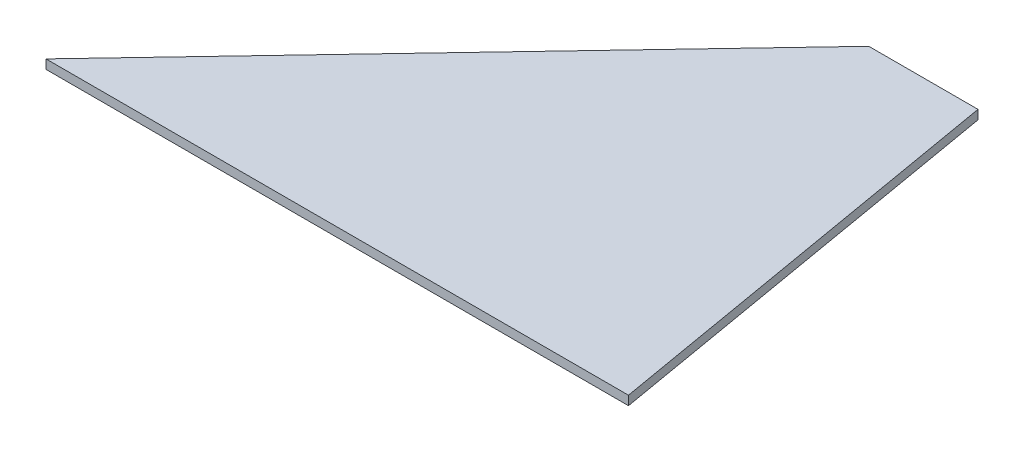
ISO-10303-21;
HEADER;
FILE_DESCRIPTION(('STEP AP214'),'2;1');
FILE_NAME('part.step','',(''),(''),'','','');
FILE_SCHEMA(('AUTOMOTIVE_DESIGN { 1 0 10303 214 1 1 1 1 }'));
ENDSEC;
DATA;
#1=APPLICATION_CONTEXT('core data for automotive mechanical design processes');
#2=APPLICATION_PROTOCOL_DEFINITION('international standard','automotive_design',2000,#1);
#3=PRODUCT_CONTEXT('',#1,'mechanical');
#4=PRODUCT('Part','Part','',(#3));
#5=PRODUCT_RELATED_PRODUCT_CATEGORY('part','',(#4));
#6=PRODUCT_DEFINITION_FORMATION('','',#4);
#7=PRODUCT_DEFINITION_CONTEXT('part definition',#1,'design');
#8=PRODUCT_DEFINITION('design','',#6,#7);
#9=PRODUCT_DEFINITION_SHAPE('','',#8);
#10=(LENGTH_UNIT() NAMED_UNIT(*) SI_UNIT(.MILLI.,.METRE.));
#11=(NAMED_UNIT(*) PLANE_ANGLE_UNIT() SI_UNIT($,.RADIAN.));
#12=(NAMED_UNIT(*) SI_UNIT($,.STERADIAN.) SOLID_ANGLE_UNIT());
#13=UNCERTAINTY_MEASURE_WITH_UNIT(LENGTH_MEASURE(1.E-05),#10,'distance_accuracy_value','');
#14=(GEOMETRIC_REPRESENTATION_CONTEXT(3) GLOBAL_UNCERTAINTY_ASSIGNED_CONTEXT((#13)) GLOBAL_UNIT_ASSIGNED_CONTEXT((#10,
#11,#12)) REPRESENTATION_CONTEXT('',''));
#15=CARTESIAN_POINT('',(0.,0.,0.));
#16=DIRECTION('',(0.,0.,1.));
#17=DIRECTION('',(1.,0.,0.));
#18=AXIS2_PLACEMENT_3D('',#15,#16,#17);
#19=CARTESIAN_POINT('',(0.,3.175,0.));
#20=DIRECTION('',(0.,0.,-1.));
#21=DIRECTION('',(-1.,0.,0.));
#22=AXIS2_PLACEMENT_3D('',#19,#20,#21);
#23=PLANE('',#22);
#24=DIRECTION('',(1.,0.,0.));
#25=VECTOR('',#24,1.);
#26=CARTESIAN_POINT('',(0.,0.,0.));
#27=LINE('',#26,#25);
#28=CARTESIAN_POINT('',(-203.2,0.,0.));
#29=VERTEX_POINT('',#28);
#30=CARTESIAN_POINT('',(0.,0.,0.));
#31=VERTEX_POINT('',#30);
#32=EDGE_CURVE('E98',#29,#31,#27,.T.);
#33=ORIENTED_EDGE('',*,*,#32,.T.);
#34=DIRECTION('',(0.,-1.,0.));
#35=VECTOR('',#34,1.);
#36=CARTESIAN_POINT('',(0.,3.175,0.));
#37=LINE('',#36,#35);
#38=CARTESIAN_POINT('',(0.,3.175,0.));
#39=VERTEX_POINT('',#38);
#40=EDGE_CURVE('E11',#39,#31,#37,.T.);
#41=ORIENTED_EDGE('',*,*,#40,.F.);
#42=DIRECTION('',(1.,0.,0.));
#43=VECTOR('',#42,1.);
#44=CARTESIAN_POINT('',(0.,3.175,0.));
#45=LINE('',#44,#43);
#46=CARTESIAN_POINT('',(-203.2,3.175,0.));
#47=VERTEX_POINT('',#46);
#48=EDGE_CURVE('E86',#47,#39,#45,.T.);
#49=ORIENTED_EDGE('',*,*,#48,.F.);
#50=DIRECTION('',(0.,-1.,0.));
#51=VECTOR('',#50,1.);
#52=CARTESIAN_POINT('',(-203.2,3.175,0.));
#53=LINE('',#52,#51);
#54=EDGE_CURVE('E94',#47,#29,#53,.T.);
#55=ORIENTED_EDGE('',*,*,#54,.T.);
#56=EDGE_LOOP('',(#33,#41,#49,#55));
#57=FACE_BOUND('',#56,.T.);
#58=ADVANCED_FACE('F35',(#57),#23,.F.);
#59=CARTESIAN_POINT('',(0.,3.175,0.));
#60=DIRECTION('',(-0.985460115744348,0.,0.169906916507646));
#61=DIRECTION('',(0.169906916507646,0.,0.985460115744348));
#62=AXIS2_PLACEMENT_3D('',#59,#60,#61);
#63=PLANE('',#62);
#64=DIRECTION('',(-0.169906916507646,0.,-0.985460115744348));
#65=VECTOR('',#64,1.);
#66=CARTESIAN_POINT('',(0.,0.,0.));
#67=LINE('',#66,#65);
#68=CARTESIAN_POINT('',(-25.4,0.,-147.32));
#69=VERTEX_POINT('',#68);
#70=EDGE_CURVE('E90',#31,#69,#67,.T.);
#71=ORIENTED_EDGE('',*,*,#70,.T.);
#72=DIRECTION('',(0.,-1.,0.));
#73=VECTOR('',#72,1.);
#74=CARTESIAN_POINT('',(-25.4,3.175,-147.32));
#75=LINE('',#74,#73);
#76=CARTESIAN_POINT('',(-25.4,3.175,-147.32));
#77=VERTEX_POINT('',#76);
#78=EDGE_CURVE('E43',#77,#69,#75,.T.);
#79=ORIENTED_EDGE('',*,*,#78,.F.);
#80=DIRECTION('',(-0.169906916507646,0.,-0.985460115744348));
#81=VECTOR('',#80,1.);
#82=CARTESIAN_POINT('',(0.,3.175,0.));
#83=LINE('',#82,#81);
#84=EDGE_CURVE('E81',#39,#77,#83,.T.);
#85=ORIENTED_EDGE('',*,*,#84,.F.);
#86=ORIENTED_EDGE('',*,*,#40,.T.);
#87=EDGE_LOOP('',(#71,#79,#85,#86));
#88=FACE_BOUND('',#87,.T.);
#89=ADVANCED_FACE('F89',(#88),#63,.F.);
#90=CARTESIAN_POINT('',(0.,3.175,-147.32));
#91=DIRECTION('',(0.,0.,1.));
#92=DIRECTION('',(1.,0.,0.));
#93=AXIS2_PLACEMENT_3D('',#90,#91,#92);
#94=PLANE('',#93);
#95=DIRECTION('',(-1.,0.,0.));
#96=VECTOR('',#95,1.);
#97=CARTESIAN_POINT('',(0.,0.,-147.32));
#98=LINE('',#97,#96);
#99=CARTESIAN_POINT('',(-63.5,0.,-147.32));
#100=VERTEX_POINT('',#99);
#101=EDGE_CURVE('E68',#69,#100,#98,.T.);
#102=ORIENTED_EDGE('',*,*,#101,.T.);
#103=DIRECTION('',(0.,-1.,0.));
#104=VECTOR('',#103,1.);
#105=CARTESIAN_POINT('',(-63.5,3.175,-147.32));
#106=LINE('',#105,#104);
#107=CARTESIAN_POINT('',(-63.5,3.175,-147.32));
#108=VERTEX_POINT('',#107);
#109=EDGE_CURVE('E91',#108,#100,#106,.T.);
#110=ORIENTED_EDGE('',*,*,#109,.F.);
#111=DIRECTION('',(-1.,0.,0.));
#112=VECTOR('',#111,1.);
#113=CARTESIAN_POINT('',(0.,3.175,-147.32));
#114=LINE('',#113,#112);
#115=EDGE_CURVE('E84',#77,#108,#114,.T.);
#116=ORIENTED_EDGE('',*,*,#115,.F.);
#117=ORIENTED_EDGE('',*,*,#78,.T.);
#118=EDGE_LOOP('',(#102,#110,#116,#117));
#119=FACE_BOUND('',#118,.T.);
#120=ADVANCED_FACE('F92',(#119),#94,.F.);
#121=CARTESIAN_POINT('',(-106.990890593207,3.175,-101.4568790108));
#122=DIRECTION('',(0.725623851173435,0.,0.688091583009292));
#123=DIRECTION('',(0.688091583009292,0.,-0.725623851173435));
#124=AXIS2_PLACEMENT_3D('',#121,#122,#123);
#125=PLANE('',#124);
#126=DIRECTION('',(-0.688091583009292,0.,0.725623851173435));
#127=VECTOR('',#126,1.);
#128=CARTESIAN_POINT('',(-106.990890593207,0.,-101.4568790108));
#129=LINE('',#128,#127);
#130=EDGE_CURVE('E74',#100,#29,#129,.T.);
#131=ORIENTED_EDGE('',*,*,#130,.T.);
#132=ORIENTED_EDGE('',*,*,#54,.F.);
#133=DIRECTION('',(-0.688091583009292,0.,0.725623851173435));
#134=VECTOR('',#133,1.);
#135=CARTESIAN_POINT('',(-106.990890593207,3.175,-101.4568790108));
#136=LINE('',#135,#134);
#137=EDGE_CURVE('E51',#108,#47,#136,.T.);
#138=ORIENTED_EDGE('',*,*,#137,.F.);
#139=ORIENTED_EDGE('',*,*,#109,.T.);
#140=EDGE_LOOP('',(#131,#132,#138,#139));
#141=FACE_BOUND('',#140,.T.);
#142=ADVANCED_FACE('F105',(#141),#125,.F.);
#143=CARTESIAN_POINT('',(0.,3.175,0.));
#144=DIRECTION('',(0.,1.,0.));
#145=DIRECTION('',(0.,0.,1.));
#146=AXIS2_PLACEMENT_3D('',#143,#144,#145);
#147=PLANE('',#146);
#148=ORIENTED_EDGE('',*,*,#48,.T.);
#149=ORIENTED_EDGE('',*,*,#84,.T.);
#150=ORIENTED_EDGE('',*,*,#115,.T.);
#151=ORIENTED_EDGE('',*,*,#137,.T.);
#152=EDGE_LOOP('',(#148,#149,#150,#151));
#153=FACE_BOUND('',#152,.T.);
#154=ADVANCED_FACE('F82',(#153),#147,.T.);
#155=CARTESIAN_POINT('',(0.,0.,0.));
#156=DIRECTION('',(0.,1.,0.));
#157=DIRECTION('',(0.,0.,1.));
#158=AXIS2_PLACEMENT_3D('',#155,#156,#157);
#159=PLANE('',#158);
#160=ORIENTED_EDGE('',*,*,#32,.F.);
#161=ORIENTED_EDGE('',*,*,#130,.F.);
#162=ORIENTED_EDGE('',*,*,#101,.F.);
#163=ORIENTED_EDGE('',*,*,#70,.F.);
#164=EDGE_LOOP('',(#160,#161,#162,#163));
#165=FACE_BOUND('',#164,.T.);
#166=ADVANCED_FACE('F108',(#165),#159,.F.);
#167=CLOSED_SHELL('',(#58,#89,#120,#142,#154,#166));
#168=MANIFOLD_SOLID_BREP('B2',#167);
#169=ADVANCED_BREP_SHAPE_REPRESENTATION('',(#18,#168),#14);
#170=SHAPE_DEFINITION_REPRESENTATION(#9,#169);
ENDSEC;
END-ISO-10303-21;
